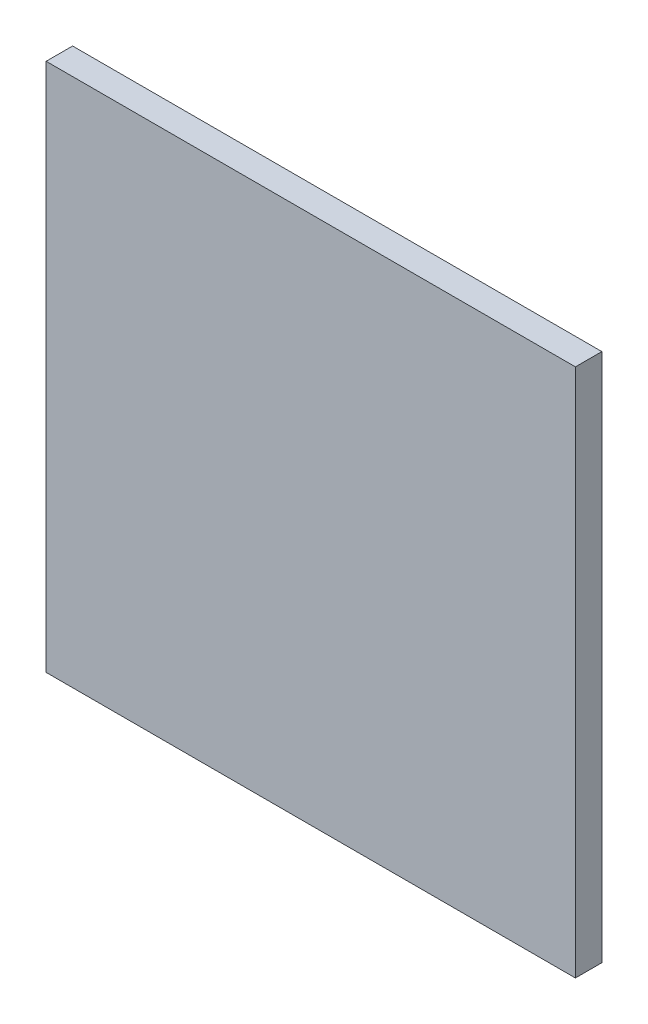
ISO-10303-21;
HEADER;
FILE_DESCRIPTION(('STEP AP214'),'2;1');
FILE_NAME('part.step','',(''),(''),'','','');
FILE_SCHEMA(('AUTOMOTIVE_DESIGN { 1 0 10303 214 1 1 1 1 }'));
ENDSEC;
DATA;
#1=APPLICATION_CONTEXT('core data for automotive mechanical design processes');
#2=APPLICATION_PROTOCOL_DEFINITION('international standard','automotive_design',2000,#1);
#3=PRODUCT_CONTEXT('',#1,'mechanical');
#4=PRODUCT('Part','Part','',(#3));
#5=PRODUCT_RELATED_PRODUCT_CATEGORY('part','',(#4));
#6=PRODUCT_DEFINITION_FORMATION('','',#4);
#7=PRODUCT_DEFINITION_CONTEXT('part definition',#1,'design');
#8=PRODUCT_DEFINITION('design','',#6,#7);
#9=PRODUCT_DEFINITION_SHAPE('','',#8);
#10=(LENGTH_UNIT() NAMED_UNIT(*) SI_UNIT(.MILLI.,.METRE.));
#11=(NAMED_UNIT(*) PLANE_ANGLE_UNIT() SI_UNIT($,.RADIAN.));
#12=(NAMED_UNIT(*) SI_UNIT($,.STERADIAN.) SOLID_ANGLE_UNIT());
#13=UNCERTAINTY_MEASURE_WITH_UNIT(LENGTH_MEASURE(1.E-05),#10,'distance_accuracy_value','');
#14=(GEOMETRIC_REPRESENTATION_CONTEXT(3) GLOBAL_UNCERTAINTY_ASSIGNED_CONTEXT((#13)) GLOBAL_UNIT_ASSIGNED_CONTEXT((#10,
#11,#12)) REPRESENTATION_CONTEXT('',''));
#15=CARTESIAN_POINT('',(0.,0.,0.));
#16=DIRECTION('',(0.,0.,1.));
#17=DIRECTION('',(1.,0.,0.));
#18=AXIS2_PLACEMENT_3D('',#15,#16,#17);
#19=CARTESIAN_POINT('',(10.,10.,1.));
#20=DIRECTION('',(-1.,0.,0.));
#21=DIRECTION('',(0.,-1.,0.));
#22=AXIS2_PLACEMENT_3D('',#19,#20,#21);
#23=PLANE('',#22);
#24=DIRECTION('',(0.,1.,0.));
#25=VECTOR('',#24,1.);
#26=CARTESIAN_POINT('',(10.,10.,0.));
#27=LINE('',#26,#25);
#28=CARTESIAN_POINT('',(10.,-10.,0.));
#29=VERTEX_POINT('',#28);
#30=CARTESIAN_POINT('',(10.,10.,0.));
#31=VERTEX_POINT('',#30);
#32=EDGE_CURVE('E107',#29,#31,#27,.T.);
#33=ORIENTED_EDGE('',*,*,#32,.T.);
#34=DIRECTION('',(0.,0.,-1.));
#35=VECTOR('',#34,1.);
#36=CARTESIAN_POINT('',(10.,10.,1.));
#37=LINE('',#36,#35);
#38=CARTESIAN_POINT('',(10.,10.,1.));
#39=VERTEX_POINT('',#38);
#40=EDGE_CURVE('E11',#39,#31,#37,.T.);
#41=ORIENTED_EDGE('',*,*,#40,.F.);
#42=DIRECTION('',(0.,1.,0.));
#43=VECTOR('',#42,1.);
#44=CARTESIAN_POINT('',(10.,10.,1.));
#45=LINE('',#44,#43);
#46=CARTESIAN_POINT('',(10.,-10.,1.));
#47=VERTEX_POINT('',#46);
#48=EDGE_CURVE('E91',#47,#39,#45,.T.);
#49=ORIENTED_EDGE('',*,*,#48,.F.);
#50=DIRECTION('',(0.,0.,-1.));
#51=VECTOR('',#50,1.);
#52=CARTESIAN_POINT('',(10.,-10.,1.));
#53=LINE('',#52,#51);
#54=EDGE_CURVE('E103',#47,#29,#53,.T.);
#55=ORIENTED_EDGE('',*,*,#54,.T.);
#56=EDGE_LOOP('',(#33,#41,#49,#55));
#57=FACE_BOUND('',#56,.T.);
#58=ADVANCED_FACE('F39',(#57),#23,.F.);
#59=CARTESIAN_POINT('',(10.,10.,1.));
#60=DIRECTION('',(0.,-1.,0.));
#61=DIRECTION('',(0.,0.,-1.));
#62=AXIS2_PLACEMENT_3D('',#59,#60,#61);
#63=PLANE('',#62);
#64=DIRECTION('',(-1.,0.,0.));
#65=VECTOR('',#64,1.);
#66=CARTESIAN_POINT('',(10.,10.,0.));
#67=LINE('',#66,#65);
#68=CARTESIAN_POINT('',(-10.,10.,0.));
#69=VERTEX_POINT('',#68);
#70=EDGE_CURVE('E96',#31,#69,#67,.T.);
#71=ORIENTED_EDGE('',*,*,#70,.T.);
#72=DIRECTION('',(0.,0.,-1.));
#73=VECTOR('',#72,1.);
#74=CARTESIAN_POINT('',(-10.,10.,1.));
#75=LINE('',#74,#73);
#76=CARTESIAN_POINT('',(-10.,10.,1.));
#77=VERTEX_POINT('',#76);
#78=EDGE_CURVE('E48',#77,#69,#75,.T.);
#79=ORIENTED_EDGE('',*,*,#78,.F.);
#80=DIRECTION('',(-1.,0.,0.));
#81=VECTOR('',#80,1.);
#82=CARTESIAN_POINT('',(10.,10.,1.));
#83=LINE('',#82,#81);
#84=EDGE_CURVE('E86',#39,#77,#83,.T.);
#85=ORIENTED_EDGE('',*,*,#84,.F.);
#86=ORIENTED_EDGE('',*,*,#40,.T.);
#87=EDGE_LOOP('',(#71,#79,#85,#86));
#88=FACE_BOUND('',#87,.T.);
#89=ADVANCED_FACE('F95',(#88),#63,.F.);
#90=CARTESIAN_POINT('',(-10.,10.,1.));
#91=DIRECTION('',(1.,0.,0.));
#92=DIRECTION('',(0.,1.,0.));
#93=AXIS2_PLACEMENT_3D('',#90,#91,#92);
#94=PLANE('',#93);
#95=DIRECTION('',(0.,-1.,0.));
#96=VECTOR('',#95,1.);
#97=CARTESIAN_POINT('',(-10.,10.,0.));
#98=LINE('',#97,#96);
#99=CARTESIAN_POINT('',(-10.,-10.,0.));
#100=VERTEX_POINT('',#99);
#101=EDGE_CURVE('E73',#69,#100,#98,.T.);
#102=ORIENTED_EDGE('',*,*,#101,.T.);
#103=DIRECTION('',(0.,0.,-1.));
#104=VECTOR('',#103,1.);
#105=CARTESIAN_POINT('',(-10.,-10.,1.));
#106=LINE('',#105,#104);
#107=CARTESIAN_POINT('',(-10.,-10.,1.));
#108=VERTEX_POINT('',#107);
#109=EDGE_CURVE('E98',#108,#100,#106,.T.);
#110=ORIENTED_EDGE('',*,*,#109,.F.);
#111=DIRECTION('',(0.,-1.,0.));
#112=VECTOR('',#111,1.);
#113=CARTESIAN_POINT('',(-10.,10.,1.));
#114=LINE('',#113,#112);
#115=EDGE_CURVE('E89',#77,#108,#114,.T.);
#116=ORIENTED_EDGE('',*,*,#115,.F.);
#117=ORIENTED_EDGE('',*,*,#78,.T.);
#118=EDGE_LOOP('',(#102,#110,#116,#117));
#119=FACE_BOUND('',#118,.T.);
#120=ADVANCED_FACE('F99',(#119),#94,.F.);
#121=CARTESIAN_POINT('',(10.,-10.,1.));
#122=DIRECTION('',(0.,1.,0.));
#123=DIRECTION('',(-1.,0.,0.));
#124=AXIS2_PLACEMENT_3D('',#121,#122,#123);
#125=PLANE('',#124);
#126=DIRECTION('',(1.,0.,0.));
#127=VECTOR('',#126,1.);
#128=CARTESIAN_POINT('',(10.,-10.,0.));
#129=LINE('',#128,#127);
#130=EDGE_CURVE('E79',#100,#29,#129,.T.);
#131=ORIENTED_EDGE('',*,*,#130,.T.);
#132=ORIENTED_EDGE('',*,*,#54,.F.);
#133=DIRECTION('',(1.,0.,0.));
#134=VECTOR('',#133,1.);
#135=CARTESIAN_POINT('',(10.,-10.,1.));
#136=LINE('',#135,#134);
#137=EDGE_CURVE('E56',#108,#47,#136,.T.);
#138=ORIENTED_EDGE('',*,*,#137,.F.);
#139=ORIENTED_EDGE('',*,*,#109,.T.);
#140=EDGE_LOOP('',(#131,#132,#138,#139));
#141=FACE_BOUND('',#140,.T.);
#142=ADVANCED_FACE('F120',(#141),#125,.F.);
#143=CARTESIAN_POINT('',(0.,0.,1.));
#144=DIRECTION('',(0.,0.,-1.));
#145=DIRECTION('',(-1.,0.,0.));
#146=AXIS2_PLACEMENT_3D('',#143,#144,#145);
#147=PLANE('',#146);
#148=ORIENTED_EDGE('',*,*,#48,.T.);
#149=ORIENTED_EDGE('',*,*,#84,.T.);
#150=ORIENTED_EDGE('',*,*,#115,.T.);
#151=ORIENTED_EDGE('',*,*,#137,.T.);
#152=EDGE_LOOP('',(#148,#149,#150,#151));
#153=FACE_BOUND('',#152,.T.);
#154=ADVANCED_FACE('F87',(#153),#147,.F.);
#155=CARTESIAN_POINT('',(0.,0.,0.));
#156=DIRECTION('',(0.,0.,-1.));
#157=DIRECTION('',(-1.,0.,0.));
#158=AXIS2_PLACEMENT_3D('',#155,#156,#157);
#159=PLANE('',#158);
#160=ORIENTED_EDGE('',*,*,#32,.F.);
#161=ORIENTED_EDGE('',*,*,#130,.F.);
#162=ORIENTED_EDGE('',*,*,#101,.F.);
#163=ORIENTED_EDGE('',*,*,#70,.F.);
#164=EDGE_LOOP('',(#160,#161,#162,#163));
#165=FACE_BOUND('',#164,.T.);
#166=ADVANCED_FACE('F123',(#165),#159,.T.);
#167=CLOSED_SHELL('',(#58,#89,#120,#142,#154,#166));
#168=MANIFOLD_SOLID_BREP('B2',#167);
#169=ADVANCED_BREP_SHAPE_REPRESENTATION('',(#18,#168),#14);
#170=SHAPE_DEFINITION_REPRESENTATION(#9,#169);
ENDSEC;
END-ISO-10303-21;
